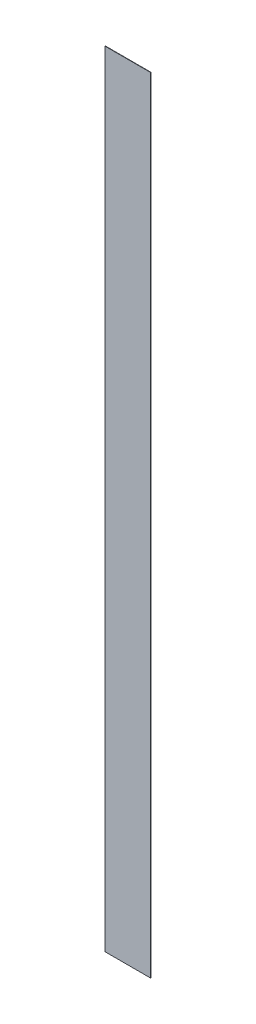
ISO-10303-21;
HEADER;
FILE_DESCRIPTION(('STEP AP214'),'2;1');
FILE_NAME('part.step','',(''),(''),'','','');
FILE_SCHEMA(('AUTOMOTIVE_DESIGN { 1 0 10303 214 1 1 1 1 }'));
ENDSEC;
DATA;
#1=APPLICATION_CONTEXT('core data for automotive mechanical design processes');
#2=APPLICATION_PROTOCOL_DEFINITION('international standard','automotive_design',2000,#1);
#3=PRODUCT_CONTEXT('',#1,'mechanical');
#4=PRODUCT('Part','Part','',(#3));
#5=PRODUCT_RELATED_PRODUCT_CATEGORY('part','',(#4));
#6=PRODUCT_DEFINITION_FORMATION('','',#4);
#7=PRODUCT_DEFINITION_CONTEXT('part definition',#1,'design');
#8=PRODUCT_DEFINITION('design','',#6,#7);
#9=PRODUCT_DEFINITION_SHAPE('','',#8);
#10=(LENGTH_UNIT() NAMED_UNIT(*) SI_UNIT(.MILLI.,.METRE.));
#11=(NAMED_UNIT(*) PLANE_ANGLE_UNIT() SI_UNIT($,.RADIAN.));
#12=(NAMED_UNIT(*) SI_UNIT($,.STERADIAN.) SOLID_ANGLE_UNIT());
#13=UNCERTAINTY_MEASURE_WITH_UNIT(LENGTH_MEASURE(1.E-05),#10,'distance_accuracy_value','');
#14=(GEOMETRIC_REPRESENTATION_CONTEXT(3) GLOBAL_UNCERTAINTY_ASSIGNED_CONTEXT((#13)) GLOBAL_UNIT_ASSIGNED_CONTEXT((#10,
#11,#12)) REPRESENTATION_CONTEXT('',''));
#15=CARTESIAN_POINT('',(0.,0.,0.));
#16=DIRECTION('',(0.,0.,1.));
#17=DIRECTION('',(1.,0.,0.));
#18=AXIS2_PLACEMENT_3D('',#15,#16,#17);
#19=CARTESIAN_POINT('',(-45.2252626190217,37.0020156460768,0.14));
#20=DIRECTION('',(1.,0.,0.));
#21=DIRECTION('',(0.,0.,-1.));
#22=AXIS2_PLACEMENT_3D('',#19,#20,#21);
#23=PLANE('',#22);
#24=DIRECTION('',(0.,-1.,0.));
#25=VECTOR('',#24,1.);
#26=CARTESIAN_POINT('',(-45.2252626190217,37.0020156460768,0.));
#27=LINE('',#26,#25);
#28=CARTESIAN_POINT('',(-45.2252626190217,337.002015646077,0.));
#29=VERTEX_POINT('',#28);
#30=CARTESIAN_POINT('',(-45.2252626190217,37.0020156460768,0.));
#31=VERTEX_POINT('',#30);
#32=EDGE_CURVE('E98',#29,#31,#27,.T.);
#33=ORIENTED_EDGE('',*,*,#32,.T.);
#34=DIRECTION('',(0.,0.,-1.));
#35=VECTOR('',#34,1.);
#36=CARTESIAN_POINT('',(-45.2252626190217,37.0020156460768,0.14));
#37=LINE('',#36,#35);
#38=CARTESIAN_POINT('',(-45.2252626190217,37.0020156460768,0.14));
#39=VERTEX_POINT('',#38);
#40=EDGE_CURVE('E11',#39,#31,#37,.T.);
#41=ORIENTED_EDGE('',*,*,#40,.F.);
#42=DIRECTION('',(0.,-1.,0.));
#43=VECTOR('',#42,1.);
#44=CARTESIAN_POINT('',(-45.2252626190217,37.0020156460768,0.14));
#45=LINE('',#44,#43);
#46=CARTESIAN_POINT('',(-45.2252626190217,337.002015646077,0.14));
#47=VERTEX_POINT('',#46);
#48=EDGE_CURVE('E86',#47,#39,#45,.T.);
#49=ORIENTED_EDGE('',*,*,#48,.F.);
#50=DIRECTION('',(0.,0.,-1.));
#51=VECTOR('',#50,1.);
#52=CARTESIAN_POINT('',(-45.2252626190217,337.002015646077,0.14));
#53=LINE('',#52,#51);
#54=EDGE_CURVE('E94',#47,#29,#53,.T.);
#55=ORIENTED_EDGE('',*,*,#54,.T.);
#56=EDGE_LOOP('',(#33,#41,#49,#55));
#57=FACE_BOUND('',#56,.T.);
#58=ADVANCED_FACE('F35',(#57),#23,.F.);
#59=CARTESIAN_POINT('',(-45.2252626190217,37.0020156460768,0.14));
#60=DIRECTION('',(0.,1.,0.));
#61=DIRECTION('',(0.,0.,1.));
#62=AXIS2_PLACEMENT_3D('',#59,#60,#61);
#63=PLANE('',#62);
#64=DIRECTION('',(1.,0.,0.));
#65=VECTOR('',#64,1.);
#66=CARTESIAN_POINT('',(-45.2252626190217,37.0020156460768,0.));
#67=LINE('',#66,#65);
#68=CARTESIAN_POINT('',(-27.8734646744184,37.0020156460768,0.));
#69=VERTEX_POINT('',#68);
#70=EDGE_CURVE('E90',#31,#69,#67,.T.);
#71=ORIENTED_EDGE('',*,*,#70,.T.);
#72=DIRECTION('',(0.,0.,-1.));
#73=VECTOR('',#72,1.);
#74=CARTESIAN_POINT('',(-27.8734646744184,37.0020156460768,0.14));
#75=LINE('',#74,#73);
#76=CARTESIAN_POINT('',(-27.8734646744184,37.0020156460768,0.14));
#77=VERTEX_POINT('',#76);
#78=EDGE_CURVE('E43',#77,#69,#75,.T.);
#79=ORIENTED_EDGE('',*,*,#78,.F.);
#80=DIRECTION('',(1.,0.,0.));
#81=VECTOR('',#80,1.);
#82=CARTESIAN_POINT('',(-45.2252626190217,37.0020156460768,0.14));
#83=LINE('',#82,#81);
#84=EDGE_CURVE('E81',#39,#77,#83,.T.);
#85=ORIENTED_EDGE('',*,*,#84,.F.);
#86=ORIENTED_EDGE('',*,*,#40,.T.);
#87=EDGE_LOOP('',(#71,#79,#85,#86));
#88=FACE_BOUND('',#87,.T.);
#89=ADVANCED_FACE('F89',(#88),#63,.F.);
#90=CARTESIAN_POINT('',(-27.8734646744184,37.0020156460768,0.14));
#91=DIRECTION('',(-1.,0.,0.));
#92=DIRECTION('',(0.,0.,1.));
#93=AXIS2_PLACEMENT_3D('',#90,#91,#92);
#94=PLANE('',#93);
#95=DIRECTION('',(0.,1.,0.));
#96=VECTOR('',#95,1.);
#97=CARTESIAN_POINT('',(-27.8734646744184,37.0020156460768,0.));
#98=LINE('',#97,#96);
#99=CARTESIAN_POINT('',(-27.8734646744184,337.002015646077,0.));
#100=VERTEX_POINT('',#99);
#101=EDGE_CURVE('E68',#69,#100,#98,.T.);
#102=ORIENTED_EDGE('',*,*,#101,.T.);
#103=DIRECTION('',(0.,0.,-1.));
#104=VECTOR('',#103,1.);
#105=CARTESIAN_POINT('',(-27.8734646744184,337.002015646077,0.14));
#106=LINE('',#105,#104);
#107=CARTESIAN_POINT('',(-27.8734646744184,337.002015646077,0.14));
#108=VERTEX_POINT('',#107);
#109=EDGE_CURVE('E91',#108,#100,#106,.T.);
#110=ORIENTED_EDGE('',*,*,#109,.F.);
#111=DIRECTION('',(0.,1.,0.));
#112=VECTOR('',#111,1.);
#113=CARTESIAN_POINT('',(-27.8734646744184,37.0020156460768,0.14));
#114=LINE('',#113,#112);
#115=EDGE_CURVE('E84',#77,#108,#114,.T.);
#116=ORIENTED_EDGE('',*,*,#115,.F.);
#117=ORIENTED_EDGE('',*,*,#78,.T.);
#118=EDGE_LOOP('',(#102,#110,#116,#117));
#119=FACE_BOUND('',#118,.T.);
#120=ADVANCED_FACE('F92',(#119),#94,.F.);
#121=CARTESIAN_POINT('',(-45.2252626190217,337.002015646077,0.14));
#122=DIRECTION('',(0.,-1.,0.));
#123=DIRECTION('',(0.,0.,-1.));
#124=AXIS2_PLACEMENT_3D('',#121,#122,#123);
#125=PLANE('',#124);
#126=DIRECTION('',(-1.,0.,0.));
#127=VECTOR('',#126,1.);
#128=CARTESIAN_POINT('',(-45.2252626190217,337.002015646077,0.));
#129=LINE('',#128,#127);
#130=EDGE_CURVE('E74',#100,#29,#129,.T.);
#131=ORIENTED_EDGE('',*,*,#130,.T.);
#132=ORIENTED_EDGE('',*,*,#54,.F.);
#133=DIRECTION('',(-1.,0.,0.));
#134=VECTOR('',#133,1.);
#135=CARTESIAN_POINT('',(-45.2252626190217,337.002015646077,0.14));
#136=LINE('',#135,#134);
#137=EDGE_CURVE('E51',#108,#47,#136,.T.);
#138=ORIENTED_EDGE('',*,*,#137,.F.);
#139=ORIENTED_EDGE('',*,*,#109,.T.);
#140=EDGE_LOOP('',(#131,#132,#138,#139));
#141=FACE_BOUND('',#140,.T.);
#142=ADVANCED_FACE('F105',(#141),#125,.F.);
#143=CARTESIAN_POINT('',(0.,0.,0.14));
#144=DIRECTION('',(0.,0.,-1.));
#145=DIRECTION('',(-1.,0.,0.));
#146=AXIS2_PLACEMENT_3D('',#143,#144,#145);
#147=PLANE('',#146);
#148=ORIENTED_EDGE('',*,*,#48,.T.);
#149=ORIENTED_EDGE('',*,*,#84,.T.);
#150=ORIENTED_EDGE('',*,*,#115,.T.);
#151=ORIENTED_EDGE('',*,*,#137,.T.);
#152=EDGE_LOOP('',(#148,#149,#150,#151));
#153=FACE_BOUND('',#152,.T.);
#154=ADVANCED_FACE('F82',(#153),#147,.F.);
#155=CARTESIAN_POINT('',(0.,0.,0.));
#156=DIRECTION('',(0.,0.,-1.));
#157=DIRECTION('',(-1.,0.,0.));
#158=AXIS2_PLACEMENT_3D('',#155,#156,#157);
#159=PLANE('',#158);
#160=ORIENTED_EDGE('',*,*,#32,.F.);
#161=ORIENTED_EDGE('',*,*,#130,.F.);
#162=ORIENTED_EDGE('',*,*,#101,.F.);
#163=ORIENTED_EDGE('',*,*,#70,.F.);
#164=EDGE_LOOP('',(#160,#161,#162,#163));
#165=FACE_BOUND('',#164,.T.);
#166=ADVANCED_FACE('F108',(#165),#159,.T.);
#167=CLOSED_SHELL('',(#58,#89,#120,#142,#154,#166));
#168=MANIFOLD_SOLID_BREP('B2',#167);
#169=ADVANCED_BREP_SHAPE_REPRESENTATION('',(#18,#168),#14);
#170=SHAPE_DEFINITION_REPRESENTATION(#9,#169);
ENDSEC;
END-ISO-10303-21;
